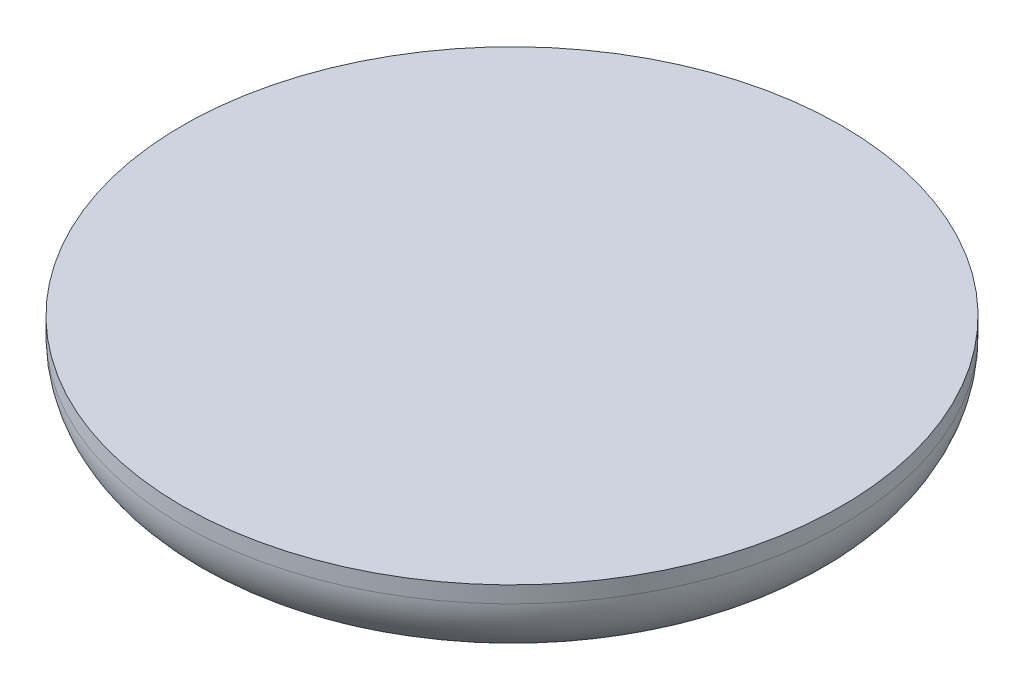
ISO-10303-21;
HEADER;
FILE_DESCRIPTION(('STEP AP214'),'2;1');
FILE_NAME('part.step','',(''),(''),'','','');
FILE_SCHEMA(('AUTOMOTIVE_DESIGN { 1 0 10303 214 1 1 1 1 }'));
ENDSEC;
DATA;
#1=APPLICATION_CONTEXT('core data for automotive mechanical design processes');
#2=APPLICATION_PROTOCOL_DEFINITION('international standard','automotive_design',2000,#1);
#3=PRODUCT_CONTEXT('',#1,'mechanical');
#4=PRODUCT('Part','Part','',(#3));
#5=PRODUCT_RELATED_PRODUCT_CATEGORY('part','',(#4));
#6=PRODUCT_DEFINITION_FORMATION('','',#4);
#7=PRODUCT_DEFINITION_CONTEXT('part definition',#1,'design');
#8=PRODUCT_DEFINITION('design','',#6,#7);
#9=PRODUCT_DEFINITION_SHAPE('','',#8);
#10=(LENGTH_UNIT() NAMED_UNIT(*) SI_UNIT(.MILLI.,.METRE.));
#11=(NAMED_UNIT(*) PLANE_ANGLE_UNIT() SI_UNIT($,.RADIAN.));
#12=(NAMED_UNIT(*) SI_UNIT($,.STERADIAN.) SOLID_ANGLE_UNIT());
#13=UNCERTAINTY_MEASURE_WITH_UNIT(LENGTH_MEASURE(1.E-05),#10,'distance_accuracy_value','');
#14=(GEOMETRIC_REPRESENTATION_CONTEXT(3) GLOBAL_UNCERTAINTY_ASSIGNED_CONTEXT((#13)) GLOBAL_UNIT_ASSIGNED_CONTEXT((#10,
#11,#12)) REPRESENTATION_CONTEXT('',''));
#15=CARTESIAN_POINT('',(0.,0.,0.));
#16=DIRECTION('',(0.,0.,1.));
#17=DIRECTION('',(1.,0.,0.));
#18=AXIS2_PLACEMENT_3D('',#15,#16,#17);
#19=CARTESIAN_POINT('',(0.,5.,0.));
#20=DIRECTION('',(0.,-1.,0.));
#21=DIRECTION('',(0.,0.,-1.));
#22=AXIS2_PLACEMENT_3D('',#19,#20,#21);
#23=CYLINDRICAL_SURFACE('',#22,20.);
#24=CARTESIAN_POINT('',(0.,4.,0.));
#25=DIRECTION('',(0.,1.,0.));
#26=DIRECTION('',(0.,0.,1.));
#27=AXIS2_PLACEMENT_3D('',#24,#25,#26);
#28=CIRCLE('',#27,20.);
#29=CARTESIAN_POINT('',(0.,4.,20.));
#30=VERTEX_POINT('',#29);
#31=EDGE_CURVE('E38',#30,#30,#28,.T.);
#32=ORIENTED_EDGE('',*,*,#31,.T.);
#33=EDGE_LOOP('',(#32));
#34=FACE_BOUND('',#33,.T.);
#35=CARTESIAN_POINT('',(0.,5.,0.));
#36=DIRECTION('',(0.,1.,0.));
#37=DIRECTION('',(0.,0.,1.));
#38=AXIS2_PLACEMENT_3D('',#35,#36,#37);
#39=CIRCLE('',#38,20.);
#40=CARTESIAN_POINT('',(0.,5.,20.));
#41=VERTEX_POINT('',#40);
#42=EDGE_CURVE('E42',#41,#41,#39,.T.);
#43=ORIENTED_EDGE('',*,*,#42,.F.);
#44=EDGE_LOOP('',(#43));
#45=FACE_BOUND('',#44,.T.);
#46=ADVANCED_FACE('F31',(#34,#45),#23,.T.);
#47=CARTESIAN_POINT('',(0.,5.,0.));
#48=DIRECTION('',(0.,1.,0.));
#49=DIRECTION('',(0.,0.,1.));
#50=AXIS2_PLACEMENT_3D('',#47,#48,#49);
#51=PLANE('',#50);
#52=ORIENTED_EDGE('',*,*,#42,.T.);
#53=EDGE_LOOP('',(#52));
#54=FACE_BOUND('',#53,.T.);
#55=ADVANCED_FACE('F49',(#54),#51,.T.);
#56=CARTESIAN_POINT('',(0.,0.,0.));
#57=DIRECTION('',(0.,1.,0.));
#58=DIRECTION('',(0.,0.,1.));
#59=AXIS2_PLACEMENT_3D('',#56,#57,#58);
#60=PLANE('',#59);
#61=CARTESIAN_POINT('',(0.,0.,0.));
#62=DIRECTION('',(0.,1.,0.));
#63=DIRECTION('',(0.,0.,1.));
#64=AXIS2_PLACEMENT_3D('',#61,#62,#63);
#65=CIRCLE('',#64,16.);
#66=CARTESIAN_POINT('',(0.,0.,16.));
#67=VERTEX_POINT('',#66);
#68=EDGE_CURVE('E10',#67,#67,#65,.F.);
#69=ORIENTED_EDGE('',*,*,#68,.T.);
#70=EDGE_LOOP('',(#69));
#71=FACE_BOUND('',#70,.T.);
#72=ADVANCED_FACE('F55',(#71),#60,.F.);
#73=CARTESIAN_POINT('',(0.,4.,0.));
#74=DIRECTION('',(0.,1.,0.));
#75=DIRECTION('',(0.,0.,1.));
#76=AXIS2_PLACEMENT_3D('',#73,#74,#75);
#77=TOROIDAL_SURFACE('',#76,16.,4.);
#78=ORIENTED_EDGE('',*,*,#68,.F.);
#79=EDGE_LOOP('',(#78));
#80=FACE_BOUND('',#79,.T.);
#81=ORIENTED_EDGE('',*,*,#31,.F.);
#82=EDGE_LOOP('',(#81));
#83=FACE_BOUND('',#82,.T.);
#84=ADVANCED_FACE('F33',(#80,#83),#77,.T.);
#85=CLOSED_SHELL('',(#46,#55,#72,#84));
#86=MANIFOLD_SOLID_BREP('B2',#85);
#87=ADVANCED_BREP_SHAPE_REPRESENTATION('',(#18,#86),#14);
#88=SHAPE_DEFINITION_REPRESENTATION(#9,#87);
ENDSEC;
END-ISO-10303-21;
